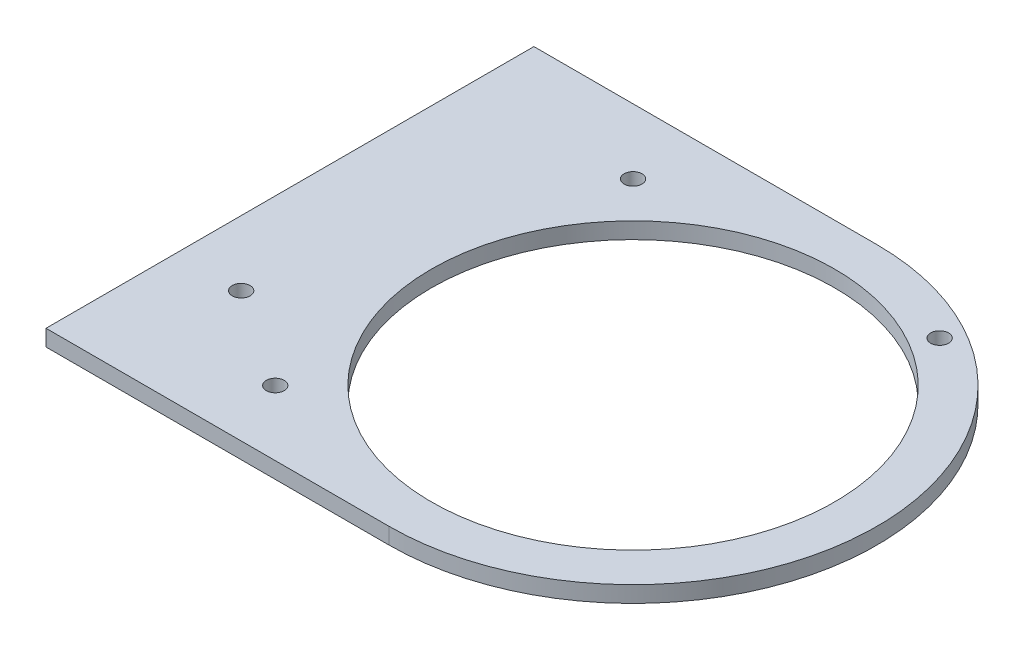
ISO-10303-21;
HEADER;
FILE_DESCRIPTION(('STEP AP214'),'2;1');
FILE_NAME('part.step','',(''),(''),'','','');
FILE_SCHEMA(('AUTOMOTIVE_DESIGN { 1 0 10303 214 1 1 1 1 }'));
ENDSEC;
DATA;
#1=APPLICATION_CONTEXT('core data for automotive mechanical design processes');
#2=APPLICATION_PROTOCOL_DEFINITION('international standard','automotive_design',2000,#1);
#3=PRODUCT_CONTEXT('',#1,'mechanical');
#4=PRODUCT('Part','Part','',(#3));
#5=PRODUCT_RELATED_PRODUCT_CATEGORY('part','',(#4));
#6=PRODUCT_DEFINITION_FORMATION('','',#4);
#7=PRODUCT_DEFINITION_CONTEXT('part definition',#1,'design');
#8=PRODUCT_DEFINITION('design','',#6,#7);
#9=PRODUCT_DEFINITION_SHAPE('','',#8);
#10=(LENGTH_UNIT() NAMED_UNIT(*) SI_UNIT(.MILLI.,.METRE.));
#11=(NAMED_UNIT(*) PLANE_ANGLE_UNIT() SI_UNIT($,.RADIAN.));
#12=(NAMED_UNIT(*) SI_UNIT($,.STERADIAN.) SOLID_ANGLE_UNIT());
#13=UNCERTAINTY_MEASURE_WITH_UNIT(LENGTH_MEASURE(1.E-05),#10,'distance_accuracy_value','');
#14=(GEOMETRIC_REPRESENTATION_CONTEXT(3) GLOBAL_UNCERTAINTY_ASSIGNED_CONTEXT((#13)) GLOBAL_UNIT_ASSIGNED_CONTEXT((#10,
#11,#12)) REPRESENTATION_CONTEXT('',''));
#15=CARTESIAN_POINT('',(0.,0.,0.));
#16=DIRECTION('',(0.,0.,1.));
#17=DIRECTION('',(1.,0.,0.));
#18=AXIS2_PLACEMENT_3D('',#15,#16,#17);
#19=CARTESIAN_POINT('',(159.258541784531,3.175,95.25));
#20=DIRECTION('',(0.,-1.,0.));
#21=DIRECTION('',(1.,0.,0.));
#22=AXIS2_PLACEMENT_3D('',#19,#20,#21);
#23=PLANE('',#22);
#24=CARTESIAN_POINT('',(57.3555854572427,3.17499999999999,69.85));
#25=DIRECTION('',(0.,1.,0.));
#26=DIRECTION('',(-1.,0.,0.));
#27=AXIS2_PLACEMENT_3D('',#24,#25,#26);
#28=CIRCLE('',#27,1.75);
#29=CARTESIAN_POINT('',(55.6055854572427,3.17499999999999,69.85));
#30=VERTEX_POINT('',#29);
#31=EDGE_CURVE('E134',#30,#30,#28,.T.);
#32=ORIENTED_EDGE('',*,*,#31,.F.);
#33=EDGE_LOOP('',(#32));
#34=FACE_BOUND('',#33,.T.);
#35=CARTESIAN_POINT('',(133.541041784534,3.175,9.68009693317952));
#36=DIRECTION('',(0.,1.,0.));
#37=DIRECTION('',(-1.,0.,0.));
#38=AXIS2_PLACEMENT_3D('',#35,#36,#37);
#39=CIRCLE('',#38,1.75000000000001);
#40=CARTESIAN_POINT('',(131.791041784534,3.175,9.68009693317952));
#41=VERTEX_POINT('',#40);
#42=EDGE_CURVE('E139',#41,#41,#39,.T.);
#43=ORIENTED_EDGE('',*,*,#42,.F.);
#44=EDGE_LOOP('',(#43));
#45=FACE_BOUND('',#44,.T.);
#46=CARTESIAN_POINT('',(76.7085417845309,3.17499999999999,82.55));
#47=DIRECTION('',(0.,1.,0.));
#48=DIRECTION('',(-1.,0.,0.));
#49=AXIS2_PLACEMENT_3D('',#46,#47,#48);
#50=CIRCLE('',#49,1.75);
#51=CARTESIAN_POINT('',(74.9585417845309,3.17499999999999,82.55));
#52=VERTEX_POINT('',#51);
#53=EDGE_CURVE('E144',#52,#52,#50,.T.);
#54=ORIENTED_EDGE('',*,*,#53,.F.);
#55=EDGE_LOOP('',(#54));
#56=FACE_BOUND('',#55,.T.);
#57=CARTESIAN_POINT('',(76.7085417845309,3.17499999999999,12.7));
#58=DIRECTION('',(0.,1.,0.));
#59=DIRECTION('',(-1.,0.,0.));
#60=AXIS2_PLACEMENT_3D('',#57,#58,#59);
#61=CIRCLE('',#60,1.75);
#62=CARTESIAN_POINT('',(74.9585417845309,3.17499999999999,12.7));
#63=VERTEX_POINT('',#62);
#64=EDGE_CURVE('E103',#63,#63,#61,.T.);
#65=ORIENTED_EDGE('',*,*,#64,.F.);
#66=EDGE_LOOP('',(#65));
#67=FACE_BOUND('',#66,.T.);
#68=CARTESIAN_POINT('',(111.633541784531,3.17499999999999,47.625));
#69=DIRECTION('',(0.,1.,0.));
#70=DIRECTION('',(-1.,0.,0.));
#71=AXIS2_PLACEMENT_3D('',#68,#69,#70);
#72=CIRCLE('',#71,39.37);
#73=CARTESIAN_POINT('',(72.2635417845309,3.17499999999999,47.625));
#74=VERTEX_POINT('',#73);
#75=EDGE_CURVE('E108',#74,#74,#72,.T.);
#76=ORIENTED_EDGE('',*,*,#75,.F.);
#77=EDGE_LOOP('',(#76));
#78=FACE_BOUND('',#77,.T.);
#79=DIRECTION('',(-1.,0.,0.));
#80=VECTOR('',#79,1.);
#81=CARTESIAN_POINT('',(159.258541784531,3.175,0.));
#82=LINE('',#81,#80);
#83=CARTESIAN_POINT('',(111.633541784531,3.17499999999999,-1.23234755733392E-11));
#84=VERTEX_POINT('',#83);
#85=CARTESIAN_POINT('',(44.6555854572427,3.17499999999999,0.));
#86=VERTEX_POINT('',#85);
#87=EDGE_CURVE('E113',#84,#86,#82,.T.);
#88=ORIENTED_EDGE('',*,*,#87,.T.);
#89=DIRECTION('',(0.,0.,-1.));
#90=VECTOR('',#89,1.);
#91=CARTESIAN_POINT('',(44.6555854572427,3.17499999999999,0.));
#92=LINE('',#91,#90);
#93=CARTESIAN_POINT('',(44.6555854572427,3.17499999999999,95.25));
#94=VERTEX_POINT('',#93);
#95=EDGE_CURVE('E53',#94,#86,#92,.T.);
#96=ORIENTED_EDGE('',*,*,#95,.F.);
#97=DIRECTION('',(-1.,0.,0.));
#98=VECTOR('',#97,1.);
#99=CARTESIAN_POINT('',(159.258541784531,3.175,95.25));
#100=LINE('',#99,#98);
#101=CARTESIAN_POINT('',(111.633541784531,3.17499999999999,95.25));
#102=VERTEX_POINT('',#101);
#103=EDGE_CURVE('E45',#102,#94,#100,.T.);
#104=ORIENTED_EDGE('',*,*,#103,.F.);
#105=CARTESIAN_POINT('',(111.633541784531,3.17499999999999,47.625));
#106=DIRECTION('',(0.,-1.,0.));
#107=DIRECTION('',(-1.,0.,0.));
#108=AXIS2_PLACEMENT_3D('',#105,#106,#107);
#109=CIRCLE('',#108,47.6250000000062);
#110=EDGE_CURVE('E96',#84,#102,#109,.T.);
#111=ORIENTED_EDGE('',*,*,#110,.F.);
#112=EDGE_LOOP('',(#88,#96,#104,#111));
#113=FACE_BOUND('',#112,.T.);
#114=ADVANCED_FACE('F37',(#34,#45,#56,#67,#78,#113),#23,.F.);
#115=CARTESIAN_POINT('',(159.258541784531,0.,95.25));
#116=DIRECTION('',(0.,1.,0.));
#117=DIRECTION('',(-1.,0.,0.));
#118=AXIS2_PLACEMENT_3D('',#115,#116,#117);
#119=PLANE('',#118);
#120=CARTESIAN_POINT('',(57.3555854572427,0.,69.85));
#121=DIRECTION('',(0.,1.,0.));
#122=DIRECTION('',(-1.,0.,0.));
#123=AXIS2_PLACEMENT_3D('',#120,#121,#122);
#124=CIRCLE('',#123,1.75);
#125=CARTESIAN_POINT('',(55.6055854572427,0.,69.85));
#126=VERTEX_POINT('',#125);
#127=EDGE_CURVE('E132',#126,#126,#124,.T.);
#128=ORIENTED_EDGE('',*,*,#127,.T.);
#129=EDGE_LOOP('',(#128));
#130=FACE_BOUND('',#129,.T.);
#131=CARTESIAN_POINT('',(133.541041784534,0.,9.68009693317952));
#132=DIRECTION('',(0.,1.,0.));
#133=DIRECTION('',(-1.,0.,0.));
#134=AXIS2_PLACEMENT_3D('',#131,#132,#133);
#135=CIRCLE('',#134,1.75000000000001);
#136=CARTESIAN_POINT('',(131.791041784534,0.,9.68009693317952));
#137=VERTEX_POINT('',#136);
#138=EDGE_CURVE('E141',#137,#137,#135,.T.);
#139=ORIENTED_EDGE('',*,*,#138,.T.);
#140=EDGE_LOOP('',(#139));
#141=FACE_BOUND('',#140,.T.);
#142=CARTESIAN_POINT('',(76.7085417845309,0.,82.55));
#143=DIRECTION('',(0.,1.,0.));
#144=DIRECTION('',(-1.,0.,0.));
#145=AXIS2_PLACEMENT_3D('',#142,#143,#144);
#146=CIRCLE('',#145,1.75);
#147=CARTESIAN_POINT('',(74.9585417845309,0.,82.55));
#148=VERTEX_POINT('',#147);
#149=EDGE_CURVE('E149',#148,#148,#146,.T.);
#150=ORIENTED_EDGE('',*,*,#149,.T.);
#151=EDGE_LOOP('',(#150));
#152=FACE_BOUND('',#151,.T.);
#153=CARTESIAN_POINT('',(76.7085417845309,0.,12.7));
#154=DIRECTION('',(0.,1.,0.));
#155=DIRECTION('',(-1.,0.,0.));
#156=AXIS2_PLACEMENT_3D('',#153,#154,#155);
#157=CIRCLE('',#156,1.75);
#158=CARTESIAN_POINT('',(74.9585417845309,0.,12.7));
#159=VERTEX_POINT('',#158);
#160=EDGE_CURVE('E101',#159,#159,#157,.T.);
#161=ORIENTED_EDGE('',*,*,#160,.T.);
#162=EDGE_LOOP('',(#161));
#163=FACE_BOUND('',#162,.T.);
#164=CARTESIAN_POINT('',(111.633541784531,0.,47.625));
#165=DIRECTION('',(0.,1.,0.));
#166=DIRECTION('',(-1.,0.,0.));
#167=AXIS2_PLACEMENT_3D('',#164,#165,#166);
#168=CIRCLE('',#167,39.37);
#169=CARTESIAN_POINT('',(72.2635417845309,0.,47.625));
#170=VERTEX_POINT('',#169);
#171=EDGE_CURVE('E110',#170,#170,#168,.T.);
#172=ORIENTED_EDGE('',*,*,#171,.T.);
#173=EDGE_LOOP('',(#172));
#174=FACE_BOUND('',#173,.T.);
#175=DIRECTION('',(1.,0.,0.));
#176=VECTOR('',#175,1.);
#177=CARTESIAN_POINT('',(159.258541784531,0.,95.25));
#178=LINE('',#177,#176);
#179=CARTESIAN_POINT('',(44.6555854572427,0.,95.25));
#180=VERTEX_POINT('',#179);
#181=CARTESIAN_POINT('',(111.633541784531,0.,95.25));
#182=VERTEX_POINT('',#181);
#183=EDGE_CURVE('E12',#180,#182,#178,.T.);
#184=ORIENTED_EDGE('',*,*,#183,.F.);
#185=DIRECTION('',(0.,0.,-1.));
#186=VECTOR('',#185,1.);
#187=CARTESIAN_POINT('',(44.6555854572427,0.,0.));
#188=LINE('',#187,#186);
#189=CARTESIAN_POINT('',(44.6555854572427,0.,0.));
#190=VERTEX_POINT('',#189);
#191=EDGE_CURVE('E76',#180,#190,#188,.T.);
#192=ORIENTED_EDGE('',*,*,#191,.T.);
#193=DIRECTION('',(1.,0.,0.));
#194=VECTOR('',#193,1.);
#195=CARTESIAN_POINT('',(159.258541784531,0.,0.));
#196=LINE('',#195,#194);
#197=CARTESIAN_POINT('',(111.633541784531,0.,0.));
#198=VERTEX_POINT('',#197);
#199=EDGE_CURVE('E40',#190,#198,#196,.T.);
#200=ORIENTED_EDGE('',*,*,#199,.T.);
#201=CARTESIAN_POINT('',(111.633541784531,0.,47.625));
#202=DIRECTION('',(0.,-1.,0.));
#203=DIRECTION('',(-1.,0.,0.));
#204=AXIS2_PLACEMENT_3D('',#201,#202,#203);
#205=CIRCLE('',#204,47.6250000000062);
#206=EDGE_CURVE('E91',#198,#182,#205,.T.);
#207=ORIENTED_EDGE('',*,*,#206,.T.);
#208=EDGE_LOOP('',(#184,#192,#200,#207));
#209=FACE_BOUND('',#208,.T.);
#210=ADVANCED_FACE('F90',(#130,#141,#152,#163,#174,#209),#119,.F.);
#211=CARTESIAN_POINT('',(0.,0.,95.25));
#212=DIRECTION('',(0.,0.,1.));
#213=DIRECTION('',(1.,0.,0.));
#214=AXIS2_PLACEMENT_3D('',#211,#212,#213);
#215=PLANE('',#214);
#216=DIRECTION('',(0.,1.,0.));
#217=VECTOR('',#216,1.);
#218=CARTESIAN_POINT('',(44.6555854572427,0.,95.25));
#219=LINE('',#218,#217);
#220=EDGE_CURVE('E79',#180,#94,#219,.T.);
#221=ORIENTED_EDGE('',*,*,#220,.F.);
#222=ORIENTED_EDGE('',*,*,#183,.T.);
#223=DIRECTION('',(0.,1.,0.));
#224=VECTOR('',#223,1.);
#225=CARTESIAN_POINT('',(111.633541784531,0.,95.25));
#226=LINE('',#225,#224);
#227=EDGE_CURVE('E95',#182,#102,#226,.T.);
#228=ORIENTED_EDGE('',*,*,#227,.T.);
#229=ORIENTED_EDGE('',*,*,#103,.T.);
#230=EDGE_LOOP('',(#221,#222,#228,#229));
#231=FACE_BOUND('',#230,.T.);
#232=ADVANCED_FACE('F85',(#231),#215,.T.);
#233=CARTESIAN_POINT('',(0.,0.,0.));
#234=DIRECTION('',(0.,0.,1.));
#235=DIRECTION('',(1.,0.,0.));
#236=AXIS2_PLACEMENT_3D('',#233,#234,#235);
#237=PLANE('',#236);
#238=ORIENTED_EDGE('',*,*,#199,.F.);
#239=DIRECTION('',(0.,1.,0.));
#240=VECTOR('',#239,1.);
#241=CARTESIAN_POINT('',(44.6555854572427,0.,0.));
#242=LINE('',#241,#240);
#243=EDGE_CURVE('E80',#190,#86,#242,.T.);
#244=ORIENTED_EDGE('',*,*,#243,.T.);
#245=ORIENTED_EDGE('',*,*,#87,.F.);
#246=DIRECTION('',(0.,1.,0.));
#247=VECTOR('',#246,1.);
#248=CARTESIAN_POINT('',(111.633541784531,0.,-1.23234755733392E-11));
#249=LINE('',#248,#247);
#250=EDGE_CURVE('E98',#198,#84,#249,.T.);
#251=ORIENTED_EDGE('',*,*,#250,.F.);
#252=EDGE_LOOP('',(#238,#244,#245,#251));
#253=FACE_BOUND('',#252,.T.);
#254=ADVANCED_FACE('F184',(#253),#237,.F.);
#255=CARTESIAN_POINT('',(111.633541784531,0.,47.625));
#256=DIRECTION('',(0.,1.,0.));
#257=DIRECTION('',(-1.,0.,0.));
#258=AXIS2_PLACEMENT_3D('',#255,#256,#257);
#259=CYLINDRICAL_SURFACE('',#258,39.37);
#260=ORIENTED_EDGE('',*,*,#171,.F.);
#261=EDGE_LOOP('',(#260));
#262=FACE_BOUND('',#261,.T.);
#263=ORIENTED_EDGE('',*,*,#75,.T.);
#264=EDGE_LOOP('',(#263));
#265=FACE_BOUND('',#264,.T.);
#266=ADVANCED_FACE('F181',(#262,#265),#259,.F.);
#267=CARTESIAN_POINT('',(111.633541784531,0.,47.625));
#268=DIRECTION('',(0.,1.,0.));
#269=DIRECTION('',(-1.,0.,0.));
#270=AXIS2_PLACEMENT_3D('',#267,#268,#269);
#271=CYLINDRICAL_SURFACE('',#270,47.6250000000062);
#272=ORIENTED_EDGE('',*,*,#110,.T.);
#273=ORIENTED_EDGE('',*,*,#227,.F.);
#274=ORIENTED_EDGE('',*,*,#206,.F.);
#275=ORIENTED_EDGE('',*,*,#250,.T.);
#276=EDGE_LOOP('',(#272,#273,#274,#275));
#277=FACE_BOUND('',#276,.T.);
#278=ADVANCED_FACE('F183',(#277),#271,.T.);
#279=CARTESIAN_POINT('',(76.7085417845309,0.,12.7));
#280=DIRECTION('',(0.,1.,0.));
#281=DIRECTION('',(-1.,0.,0.));
#282=AXIS2_PLACEMENT_3D('',#279,#280,#281);
#283=CYLINDRICAL_SURFACE('',#282,1.75);
#284=ORIENTED_EDGE('',*,*,#160,.F.);
#285=EDGE_LOOP('',(#284));
#286=FACE_BOUND('',#285,.T.);
#287=ORIENTED_EDGE('',*,*,#64,.T.);
#288=EDGE_LOOP('',(#287));
#289=FACE_BOUND('',#288,.T.);
#290=ADVANCED_FACE('F171',(#286,#289),#283,.F.);
#291=CARTESIAN_POINT('',(76.7085417845309,0.,82.55));
#292=DIRECTION('',(0.,1.,0.));
#293=DIRECTION('',(-1.,0.,0.));
#294=AXIS2_PLACEMENT_3D('',#291,#292,#293);
#295=CYLINDRICAL_SURFACE('',#294,1.75);
#296=ORIENTED_EDGE('',*,*,#149,.F.);
#297=EDGE_LOOP('',(#296));
#298=FACE_BOUND('',#297,.T.);
#299=ORIENTED_EDGE('',*,*,#53,.T.);
#300=EDGE_LOOP('',(#299));
#301=FACE_BOUND('',#300,.T.);
#302=ADVANCED_FACE('F167',(#298,#301),#295,.F.);
#303=CARTESIAN_POINT('',(133.541041784534,0.,9.68009693317952));
#304=DIRECTION('',(0.,1.,0.));
#305=DIRECTION('',(-1.,0.,0.));
#306=AXIS2_PLACEMENT_3D('',#303,#304,#305);
#307=CYLINDRICAL_SURFACE('',#306,1.75000000000001);
#308=ORIENTED_EDGE('',*,*,#138,.F.);
#309=EDGE_LOOP('',(#308));
#310=FACE_BOUND('',#309,.T.);
#311=ORIENTED_EDGE('',*,*,#42,.T.);
#312=EDGE_LOOP('',(#311));
#313=FACE_BOUND('',#312,.T.);
#314=ADVANCED_FACE('F170',(#310,#313),#307,.F.);
#315=CARTESIAN_POINT('',(44.6555854572427,0.,0.));
#316=DIRECTION('',(1.,0.,0.));
#317=DIRECTION('',(0.,1.,0.));
#318=AXIS2_PLACEMENT_3D('',#315,#316,#317);
#319=PLANE('',#318);
#320=ORIENTED_EDGE('',*,*,#95,.T.);
#321=ORIENTED_EDGE('',*,*,#243,.F.);
#322=ORIENTED_EDGE('',*,*,#191,.F.);
#323=ORIENTED_EDGE('',*,*,#220,.T.);
#324=EDGE_LOOP('',(#320,#321,#322,#323));
#325=FACE_BOUND('',#324,.T.);
#326=ADVANCED_FACE('F78',(#325),#319,.F.);
#327=CARTESIAN_POINT('',(57.3555854572427,0.,69.85));
#328=DIRECTION('',(0.,1.,0.));
#329=DIRECTION('',(-1.,0.,0.));
#330=AXIS2_PLACEMENT_3D('',#327,#328,#329);
#331=CYLINDRICAL_SURFACE('',#330,1.75);
#332=ORIENTED_EDGE('',*,*,#127,.F.);
#333=EDGE_LOOP('',(#332));
#334=FACE_BOUND('',#333,.T.);
#335=ORIENTED_EDGE('',*,*,#31,.T.);
#336=EDGE_LOOP('',(#335));
#337=FACE_BOUND('',#336,.T.);
#338=ADVANCED_FACE('F214',(#334,#337),#331,.F.);
#339=CLOSED_SHELL('',(#114,#210,#232,#254,#266,#278,#290,#302,#314,#326,#338));
#340=MANIFOLD_SOLID_BREP('B2',#339);
#341=ADVANCED_BREP_SHAPE_REPRESENTATION('',(#18,#340),#14);
#342=SHAPE_DEFINITION_REPRESENTATION(#9,#341);
ENDSEC;
END-ISO-10303-21;
